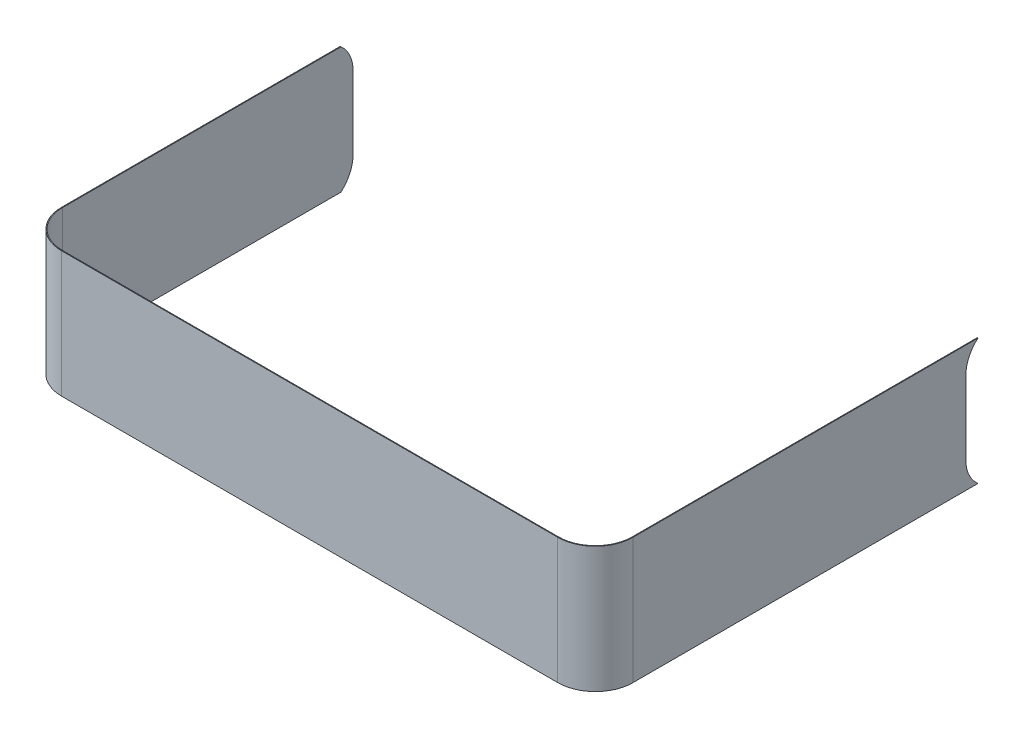
ISO-10303-21;
HEADER;
FILE_DESCRIPTION(('STEP AP214'),'2;1');
FILE_NAME('part.step','',(''),(''),'','','');
FILE_SCHEMA(('AUTOMOTIVE_DESIGN { 1 0 10303 214 1 1 1 1 }'));
ENDSEC;
DATA;
#1=APPLICATION_CONTEXT('core data for automotive mechanical design processes');
#2=APPLICATION_PROTOCOL_DEFINITION('international standard','automotive_design',2000,#1);
#3=PRODUCT_CONTEXT('',#1,'mechanical');
#4=PRODUCT('Part','Part','',(#3));
#5=PRODUCT_RELATED_PRODUCT_CATEGORY('part','',(#4));
#6=PRODUCT_DEFINITION_FORMATION('','',#4);
#7=PRODUCT_DEFINITION_CONTEXT('part definition',#1,'design');
#8=PRODUCT_DEFINITION('design','',#6,#7);
#9=PRODUCT_DEFINITION_SHAPE('','',#8);
#10=(LENGTH_UNIT() NAMED_UNIT(*) SI_UNIT(.MILLI.,.METRE.));
#11=(NAMED_UNIT(*) PLANE_ANGLE_UNIT() SI_UNIT($,.RADIAN.));
#12=(NAMED_UNIT(*) SI_UNIT($,.STERADIAN.) SOLID_ANGLE_UNIT());
#13=UNCERTAINTY_MEASURE_WITH_UNIT(LENGTH_MEASURE(1.E-05),#10,'distance_accuracy_value','');
#14=(GEOMETRIC_REPRESENTATION_CONTEXT(3) GLOBAL_UNCERTAINTY_ASSIGNED_CONTEXT((#13)) GLOBAL_UNIT_ASSIGNED_CONTEXT((#10,
#11,#12)) REPRESENTATION_CONTEXT('',''));
#15=CARTESIAN_POINT('',(0.,0.,0.));
#16=DIRECTION('',(0.,0.,1.));
#17=DIRECTION('',(1.,0.,0.));
#18=AXIS2_PLACEMENT_3D('',#15,#16,#17);
#19=CARTESIAN_POINT('',(-500.,-1672.,-500.));
#20=DIRECTION('',(1.,0.,0.));
#21=DIRECTION('',(0.,0.,-1.));
#22=AXIS2_PLACEMENT_3D('',#19,#20,#21);
#23=PLANE('',#22);
#24=DIRECTION('',(0.,0.,-1.));
#25=VECTOR('',#24,1.);
#26=CARTESIAN_POINT('',(-500.,0.,-500.));
#27=LINE('',#26,#25);
#28=CARTESIAN_POINT('',(-500.,0.,-500.));
#29=VERTEX_POINT('',#28);
#30=CARTESIAN_POINT('',(-500.,0.,-4200.49623113199));
#31=VERTEX_POINT('',#30);
#32=EDGE_CURVE('E255',#29,#31,#27,.T.);
#33=ORIENTED_EDGE('',*,*,#32,.T.);
#34=CARTESIAN_POINT('',(-500.,-350.,-3902.));
#35=DIRECTION('',(1.,0.,0.));
#36=DIRECTION('',(0.,0.,-1.));
#37=AXIS2_PLACEMENT_3D('',#34,#35,#36);
#38=CIRCLE('',#37,460.);
#39=CARTESIAN_POINT('',(-500.,-350.,-4362.));
#40=VERTEX_POINT('',#39);
#41=EDGE_CURVE('E63',#40,#31,#38,.T.);
#42=ORIENTED_EDGE('',*,*,#41,.F.);
#43=DIRECTION('',(0.,1.,0.));
#44=VECTOR('',#43,1.);
#45=CARTESIAN_POINT('',(-500.,-350.,-4362.));
#46=LINE('',#45,#44);
#47=CARTESIAN_POINT('',(-500.,-1322.,-4362.));
#48=VERTEX_POINT('',#47);
#49=EDGE_CURVE('E196',#48,#40,#46,.T.);
#50=ORIENTED_EDGE('',*,*,#49,.F.);
#51=CARTESIAN_POINT('',(-500.,-1322.,-3902.));
#52=DIRECTION('',(1.,0.,0.));
#53=DIRECTION('',(0.,0.,1.));
#54=AXIS2_PLACEMENT_3D('',#51,#52,#53);
#55=CIRCLE('',#54,460.);
#56=CARTESIAN_POINT('',(-500.,-1672.,-4200.49623113199));
#57=VERTEX_POINT('',#56);
#58=EDGE_CURVE('E192',#57,#48,#55,.T.);
#59=ORIENTED_EDGE('',*,*,#58,.F.);
#60=DIRECTION('',(0.,0.,-1.));
#61=VECTOR('',#60,1.);
#62=CARTESIAN_POINT('',(-500.,-1672.,-500.));
#63=LINE('',#62,#61);
#64=CARTESIAN_POINT('',(-500.,-1672.,-500.));
#65=VERTEX_POINT('',#64);
#66=EDGE_CURVE('E219',#65,#57,#63,.T.);
#67=ORIENTED_EDGE('',*,*,#66,.F.);
#68=DIRECTION('',(0.,1.,0.));
#69=VECTOR('',#68,1.);
#70=CARTESIAN_POINT('',(-500.,-1672.,-500.));
#71=LINE('',#70,#69);
#72=EDGE_CURVE('E309',#65,#29,#71,.T.);
#73=ORIENTED_EDGE('',*,*,#72,.T.);
#74=EDGE_LOOP('',(#33,#42,#50,#59,#67,#73));
#75=FACE_BOUND('',#74,.T.);
#76=ADVANCED_FACE('F39',(#75),#23,.F.);
#77=CARTESIAN_POINT('',(-490.,-1672.,-8890.));
#78=DIRECTION('',(-1.,0.,0.));
#79=DIRECTION('',(0.,0.,1.));
#80=AXIS2_PLACEMENT_3D('',#77,#78,#79);
#81=PLANE('',#80);
#82=DIRECTION('',(0.,1.,0.));
#83=VECTOR('',#82,1.);
#84=CARTESIAN_POINT('',(-490.,-1672.,-4362.));
#85=LINE('',#84,#83);
#86=CARTESIAN_POINT('',(-490.,-1322.,-4362.));
#87=VERTEX_POINT('',#86);
#88=CARTESIAN_POINT('',(-490.,-350.,-4362.));
#89=VERTEX_POINT('',#88);
#90=EDGE_CURVE('E319',#87,#89,#85,.T.);
#91=ORIENTED_EDGE('',*,*,#90,.T.);
#92=CARTESIAN_POINT('',(-490.,-350.,-3902.));
#93=DIRECTION('',(-1.,0.,0.));
#94=DIRECTION('',(0.,0.,1.));
#95=AXIS2_PLACEMENT_3D('',#92,#93,#94);
#96=CIRCLE('',#95,460.);
#97=CARTESIAN_POINT('',(-490.,0.,-4200.49623113199));
#98=VERTEX_POINT('',#97);
#99=EDGE_CURVE('E204',#89,#98,#96,.F.);
#100=ORIENTED_EDGE('',*,*,#99,.T.);
#101=DIRECTION('',(0.,0.,1.));
#102=VECTOR('',#101,1.);
#103=CARTESIAN_POINT('',(-490.,0.,-8890.));
#104=LINE('',#103,#102);
#105=CARTESIAN_POINT('',(-490.,0.,-500.));
#106=VERTEX_POINT('',#105);
#107=EDGE_CURVE('E259',#98,#106,#104,.T.);
#108=ORIENTED_EDGE('',*,*,#107,.T.);
#109=DIRECTION('',(0.,1.,0.));
#110=VECTOR('',#109,1.);
#111=CARTESIAN_POINT('',(-490.,-1672.,-500.));
#112=LINE('',#111,#110);
#113=CARTESIAN_POINT('',(-490.,-1672.,-500.));
#114=VERTEX_POINT('',#113);
#115=EDGE_CURVE('E305',#114,#106,#112,.T.);
#116=ORIENTED_EDGE('',*,*,#115,.F.);
#117=DIRECTION('',(0.,0.,1.));
#118=VECTOR('',#117,1.);
#119=CARTESIAN_POINT('',(-490.,-1672.,-8890.));
#120=LINE('',#119,#118);
#121=CARTESIAN_POINT('',(-490.,-1672.,-4200.49623113199));
#122=VERTEX_POINT('',#121);
#123=EDGE_CURVE('E224',#122,#114,#120,.T.);
#124=ORIENTED_EDGE('',*,*,#123,.F.);
#125=CARTESIAN_POINT('',(-490.,-1322.,-3902.));
#126=DIRECTION('',(-1.,0.,0.));
#127=DIRECTION('',(0.,0.,1.));
#128=AXIS2_PLACEMENT_3D('',#125,#126,#127);
#129=CIRCLE('',#128,460.);
#130=EDGE_CURVE('E210',#122,#87,#129,.F.);
#131=ORIENTED_EDGE('',*,*,#130,.T.);
#132=EDGE_LOOP('',(#91,#100,#108,#116,#124,#131));
#133=FACE_BOUND('',#132,.T.);
#134=ADVANCED_FACE('F348',(#133),#81,.F.);
#135=CARTESIAN_POINT('',(0.,-1672.,-500.));
#136=DIRECTION('',(0.,1.,0.));
#137=DIRECTION('',(0.,0.,1.));
#138=AXIS2_PLACEMENT_3D('',#135,#136,#137);
#139=CYLINDRICAL_SURFACE('',#138,500.);
#140=CARTESIAN_POINT('',(0.,0.,-500.));
#141=DIRECTION('',(0.,-1.,0.));
#142=DIRECTION('',(0.,0.,-1.));
#143=AXIS2_PLACEMENT_3D('',#140,#141,#142);
#144=CIRCLE('',#143,500.);
#145=CARTESIAN_POINT('',(0.,0.,0.));
#146=VERTEX_POINT('',#145);
#147=EDGE_CURVE('E214',#146,#29,#144,.T.);
#148=ORIENTED_EDGE('',*,*,#147,.T.);
#149=ORIENTED_EDGE('',*,*,#72,.F.);
#150=CARTESIAN_POINT('',(0.,-1672.,-500.));
#151=DIRECTION('',(0.,-1.,0.));
#152=DIRECTION('',(0.,0.,-1.));
#153=AXIS2_PLACEMENT_3D('',#150,#151,#152);
#154=CIRCLE('',#153,500.);
#155=CARTESIAN_POINT('',(0.,-1672.,0.));
#156=VERTEX_POINT('',#155);
#157=EDGE_CURVE('E215',#156,#65,#154,.T.);
#158=ORIENTED_EDGE('',*,*,#157,.F.);
#159=DIRECTION('',(0.,1.,0.));
#160=VECTOR('',#159,1.);
#161=CARTESIAN_POINT('',(0.,-1672.,0.));
#162=LINE('',#161,#160);
#163=EDGE_CURVE('E251',#156,#146,#162,.T.);
#164=ORIENTED_EDGE('',*,*,#163,.T.);
#165=EDGE_LOOP('',(#148,#149,#158,#164));
#166=FACE_BOUND('',#165,.T.);
#167=ADVANCED_FACE('F41',(#166),#139,.T.);
#168=CARTESIAN_POINT('',(2.22044604925031E-13,-1672.,-500.));
#169=DIRECTION('',(0.,1.,0.));
#170=DIRECTION('',(0.,0.,1.));
#171=AXIS2_PLACEMENT_3D('',#168,#169,#170);
#172=CYLINDRICAL_SURFACE('',#171,490.);
#173=CARTESIAN_POINT('',(2.22044604925031E-13,0.,-500.));
#174=DIRECTION('',(0.,1.,0.));
#175=DIRECTION('',(0.,0.,1.));
#176=AXIS2_PLACEMENT_3D('',#173,#174,#175);
#177=CIRCLE('',#176,490.);
#178=CARTESIAN_POINT('',(2.22044604925031E-13,0.,-9.99999999999973));
#179=VERTEX_POINT('',#178);
#180=EDGE_CURVE('E262',#106,#179,#177,.T.);
#181=ORIENTED_EDGE('',*,*,#180,.T.);
#182=DIRECTION('',(0.,1.,0.));
#183=VECTOR('',#182,1.);
#184=CARTESIAN_POINT('',(2.22044604925031E-13,-1672.,-9.99999999999973));
#185=LINE('',#184,#183);
#186=CARTESIAN_POINT('',(2.22044604925031E-13,-1672.,-9.99999999999973));
#187=VERTEX_POINT('',#186);
#188=EDGE_CURVE('E301',#187,#179,#185,.T.);
#189=ORIENTED_EDGE('',*,*,#188,.F.);
#190=CARTESIAN_POINT('',(2.22044604925031E-13,-1672.,-500.));
#191=DIRECTION('',(0.,1.,0.));
#192=DIRECTION('',(0.,0.,1.));
#193=AXIS2_PLACEMENT_3D('',#190,#191,#192);
#194=CIRCLE('',#193,490.);
#195=EDGE_CURVE('E227',#114,#187,#194,.T.);
#196=ORIENTED_EDGE('',*,*,#195,.F.);
#197=ORIENTED_EDGE('',*,*,#115,.T.);
#198=EDGE_LOOP('',(#181,#189,#196,#197));
#199=FACE_BOUND('',#198,.T.);
#200=ADVANCED_FACE('F344',(#199),#172,.F.);
#201=CARTESIAN_POINT('',(1.11022302462516E-13,-1672.,-9.99999999999979));
#202=DIRECTION('',(0.,0.,1.));
#203=DIRECTION('',(1.,0.,0.));
#204=AXIS2_PLACEMENT_3D('',#201,#202,#203);
#205=PLANE('',#204);
#206=DIRECTION('',(1.,0.,0.));
#207=VECTOR('',#206,1.);
#208=CARTESIAN_POINT('',(1.11022302462516E-13,0.,-9.99999999999979));
#209=LINE('',#208,#207);
#210=CARTESIAN_POINT('',(6590.,0.,-9.99999999999973));
#211=VERTEX_POINT('',#210);
#212=EDGE_CURVE('E265',#179,#211,#209,.T.);
#213=ORIENTED_EDGE('',*,*,#212,.T.);
#214=DIRECTION('',(0.,1.,0.));
#215=VECTOR('',#214,1.);
#216=CARTESIAN_POINT('',(6590.,-1672.,-9.99999999999973));
#217=LINE('',#216,#215);
#218=CARTESIAN_POINT('',(6590.,-1672.,-9.99999999999973));
#219=VERTEX_POINT('',#218);
#220=EDGE_CURVE('E297',#219,#211,#217,.T.);
#221=ORIENTED_EDGE('',*,*,#220,.F.);
#222=DIRECTION('',(1.,0.,0.));
#223=VECTOR('',#222,1.);
#224=CARTESIAN_POINT('',(1.11022302462516E-13,-1672.,-9.99999999999979));
#225=LINE('',#224,#223);
#226=EDGE_CURVE('E230',#187,#219,#225,.T.);
#227=ORIENTED_EDGE('',*,*,#226,.F.);
#228=ORIENTED_EDGE('',*,*,#188,.T.);
#229=EDGE_LOOP('',(#213,#221,#227,#228));
#230=FACE_BOUND('',#229,.T.);
#231=ADVANCED_FACE('F339',(#230),#205,.F.);
#232=CARTESIAN_POINT('',(6590.,-1672.,-499.999999999999));
#233=DIRECTION('',(0.,1.,0.));
#234=DIRECTION('',(0.,0.,1.));
#235=AXIS2_PLACEMENT_3D('',#232,#233,#234);
#236=CYLINDRICAL_SURFACE('',#235,490.);
#237=CARTESIAN_POINT('',(6590.,0.,-499.999999999999));
#238=DIRECTION('',(0.,1.,0.));
#239=DIRECTION('',(0.,0.,1.));
#240=AXIS2_PLACEMENT_3D('',#237,#238,#239);
#241=CIRCLE('',#240,490.);
#242=CARTESIAN_POINT('',(7080.,0.,-499.999999999999));
#243=VERTEX_POINT('',#242);
#244=EDGE_CURVE('E268',#211,#243,#241,.T.);
#245=ORIENTED_EDGE('',*,*,#244,.T.);
#246=DIRECTION('',(0.,1.,0.));
#247=VECTOR('',#246,1.);
#248=CARTESIAN_POINT('',(7080.,-1672.,-499.999999999999));
#249=LINE('',#248,#247);
#250=CARTESIAN_POINT('',(7080.,-1672.,-499.999999999999));
#251=VERTEX_POINT('',#250);
#252=EDGE_CURVE('E293',#251,#243,#249,.T.);
#253=ORIENTED_EDGE('',*,*,#252,.F.);
#254=CARTESIAN_POINT('',(6590.,-1672.,-499.999999999999));
#255=DIRECTION('',(0.,1.,0.));
#256=DIRECTION('',(0.,0.,1.));
#257=AXIS2_PLACEMENT_3D('',#254,#255,#256);
#258=CIRCLE('',#257,490.);
#259=EDGE_CURVE('E233',#219,#251,#258,.T.);
#260=ORIENTED_EDGE('',*,*,#259,.F.);
#261=ORIENTED_EDGE('',*,*,#220,.T.);
#262=EDGE_LOOP('',(#245,#253,#260,#261));
#263=FACE_BOUND('',#262,.T.);
#264=ADVANCED_FACE('F333',(#263),#236,.F.);
#265=CARTESIAN_POINT('',(7080.,-1672.,-499.999999999999));
#266=DIRECTION('',(1.,0.,0.));
#267=DIRECTION('',(0.,0.,-1.));
#268=AXIS2_PLACEMENT_3D('',#265,#266,#267);
#269=PLANE('',#268);
#270=DIRECTION('',(0.,-1.,0.));
#271=VECTOR('',#270,1.);
#272=CARTESIAN_POINT('',(7080.,-1672.,-4920.));
#273=LINE('',#272,#271);
#274=CARTESIAN_POINT('',(7080.,-350.,-4920.));
#275=VERTEX_POINT('',#274);
#276=CARTESIAN_POINT('',(7080.,-1322.,-4920.));
#277=VERTEX_POINT('',#276);
#278=EDGE_CURVE('E160',#275,#277,#273,.T.);
#279=ORIENTED_EDGE('',*,*,#278,.T.);
#280=CARTESIAN_POINT('',(7080.,-1322.,-5380.));
#281=DIRECTION('',(1.,0.,0.));
#282=DIRECTION('',(0.,0.,-1.));
#283=AXIS2_PLACEMENT_3D('',#280,#281,#282);
#284=CIRCLE('',#283,460.);
#285=CARTESIAN_POINT('',(7080.,-1672.,-5081.50376886801));
#286=VERTEX_POINT('',#285);
#287=EDGE_CURVE('E184',#277,#286,#284,.T.);
#288=ORIENTED_EDGE('',*,*,#287,.T.);
#289=DIRECTION('',(0.,0.,-1.));
#290=VECTOR('',#289,1.);
#291=CARTESIAN_POINT('',(7080.,-1672.,-499.999999999999));
#292=LINE('',#291,#290);
#293=EDGE_CURVE('E236',#251,#286,#292,.T.);
#294=ORIENTED_EDGE('',*,*,#293,.F.);
#295=ORIENTED_EDGE('',*,*,#252,.T.);
#296=DIRECTION('',(0.,0.,-1.));
#297=VECTOR('',#296,1.);
#298=CARTESIAN_POINT('',(7080.,0.,-499.999999999999));
#299=LINE('',#298,#297);
#300=CARTESIAN_POINT('',(7080.,0.,-5081.50376886801));
#301=VERTEX_POINT('',#300);
#302=EDGE_CURVE('E271',#243,#301,#299,.T.);
#303=ORIENTED_EDGE('',*,*,#302,.T.);
#304=CARTESIAN_POINT('',(7080.,-350.,-5380.));
#305=DIRECTION('',(1.,0.,0.));
#306=DIRECTION('',(0.,0.,-1.));
#307=AXIS2_PLACEMENT_3D('',#304,#305,#306);
#308=CIRCLE('',#307,460.);
#309=EDGE_CURVE('E55',#301,#275,#308,.T.);
#310=ORIENTED_EDGE('',*,*,#309,.T.);
#311=EDGE_LOOP('',(#279,#288,#294,#295,#303,#310));
#312=FACE_BOUND('',#311,.T.);
#313=ADVANCED_FACE('F328',(#312),#269,.F.);
#314=CARTESIAN_POINT('',(7090.,-1672.,-499.999999999999));
#315=DIRECTION('',(1.,0.,0.));
#316=DIRECTION('',(0.,0.,-1.));
#317=AXIS2_PLACEMENT_3D('',#314,#315,#316);
#318=PLANE('',#317);
#319=CARTESIAN_POINT('',(7090.,-1322.,-5380.));
#320=DIRECTION('',(1.,0.,0.));
#321=DIRECTION('',(0.,0.,-1.));
#322=AXIS2_PLACEMENT_3D('',#319,#320,#321);
#323=CIRCLE('',#322,460.);
#324=CARTESIAN_POINT('',(7090.,-1322.,-4920.));
#325=VERTEX_POINT('',#324);
#326=CARTESIAN_POINT('',(7090.,-1672.,-5081.50376886801));
#327=VERTEX_POINT('',#326);
#328=EDGE_CURVE('E163',#325,#327,#323,.T.);
#329=ORIENTED_EDGE('',*,*,#328,.F.);
#330=DIRECTION('',(0.,-1.,0.));
#331=VECTOR('',#330,1.);
#332=CARTESIAN_POINT('',(7090.,-350.,-4920.));
#333=LINE('',#332,#331);
#334=CARTESIAN_POINT('',(7090.,-350.,-4920.));
#335=VERTEX_POINT('',#334);
#336=EDGE_CURVE('E157',#335,#325,#333,.T.);
#337=ORIENTED_EDGE('',*,*,#336,.F.);
#338=CARTESIAN_POINT('',(7090.,-350.,-5380.));
#339=DIRECTION('',(1.,0.,0.));
#340=DIRECTION('',(0.,0.,1.));
#341=AXIS2_PLACEMENT_3D('',#338,#339,#340);
#342=CIRCLE('',#341,460.);
#343=CARTESIAN_POINT('',(7090.,0.,-5081.50376886801));
#344=VERTEX_POINT('',#343);
#345=EDGE_CURVE('E166',#344,#335,#342,.T.);
#346=ORIENTED_EDGE('',*,*,#345,.F.);
#347=DIRECTION('',(0.,0.,-1.));
#348=VECTOR('',#347,1.);
#349=CARTESIAN_POINT('',(7090.,0.,-499.999999999999));
#350=LINE('',#349,#348);
#351=CARTESIAN_POINT('',(7090.,0.,-499.999999999999));
#352=VERTEX_POINT('',#351);
#353=EDGE_CURVE('E275',#352,#344,#350,.T.);
#354=ORIENTED_EDGE('',*,*,#353,.F.);
#355=DIRECTION('',(0.,1.,0.));
#356=VECTOR('',#355,1.);
#357=CARTESIAN_POINT('',(7090.,-1672.,-499.999999999999));
#358=LINE('',#357,#356);
#359=CARTESIAN_POINT('',(7090.,-1672.,-499.999999999999));
#360=VERTEX_POINT('',#359);
#361=EDGE_CURVE('E290',#360,#352,#358,.T.);
#362=ORIENTED_EDGE('',*,*,#361,.F.);
#363=DIRECTION('',(0.,0.,-1.));
#364=VECTOR('',#363,1.);
#365=CARTESIAN_POINT('',(7090.,-1672.,-499.999999999999));
#366=LINE('',#365,#364);
#367=EDGE_CURVE('E240',#360,#327,#366,.T.);
#368=ORIENTED_EDGE('',*,*,#367,.T.);
#369=EDGE_LOOP('',(#329,#337,#346,#354,#362,#368));
#370=FACE_BOUND('',#369,.T.);
#371=ADVANCED_FACE('F173',(#370),#318,.T.);
#372=CARTESIAN_POINT('',(6590.,-1672.,-499.999999999999));
#373=DIRECTION('',(0.,1.,0.));
#374=DIRECTION('',(0.,0.,1.));
#375=AXIS2_PLACEMENT_3D('',#372,#373,#374);
#376=CYLINDRICAL_SURFACE('',#375,499.999999999999);
#377=CARTESIAN_POINT('',(6590.,0.,-499.999999999999));
#378=DIRECTION('',(0.,1.,0.));
#379=DIRECTION('',(0.,0.,1.));
#380=AXIS2_PLACEMENT_3D('',#377,#378,#379);
#381=CIRCLE('',#380,499.999999999999);
#382=CARTESIAN_POINT('',(6590.,0.,0.));
#383=VERTEX_POINT('',#382);
#384=EDGE_CURVE('E278',#383,#352,#381,.T.);
#385=ORIENTED_EDGE('',*,*,#384,.F.);
#386=DIRECTION('',(0.,1.,0.));
#387=VECTOR('',#386,1.);
#388=CARTESIAN_POINT('',(6590.,-1672.,0.));
#389=LINE('',#388,#387);
#390=CARTESIAN_POINT('',(6590.,-1672.,0.));
#391=VERTEX_POINT('',#390);
#392=EDGE_CURVE('E287',#391,#383,#389,.T.);
#393=ORIENTED_EDGE('',*,*,#392,.F.);
#394=CARTESIAN_POINT('',(6590.,-1672.,-499.999999999999));
#395=DIRECTION('',(0.,1.,0.));
#396=DIRECTION('',(0.,0.,1.));
#397=AXIS2_PLACEMENT_3D('',#394,#395,#396);
#398=CIRCLE('',#397,499.999999999999);
#399=EDGE_CURVE('E243',#391,#360,#398,.T.);
#400=ORIENTED_EDGE('',*,*,#399,.T.);
#401=ORIENTED_EDGE('',*,*,#361,.T.);
#402=EDGE_LOOP('',(#385,#393,#400,#401));
#403=FACE_BOUND('',#402,.T.);
#404=ADVANCED_FACE('F363',(#403),#376,.T.);
#405=CARTESIAN_POINT('',(0.,-1672.,0.));
#406=DIRECTION('',(0.,0.,1.));
#407=DIRECTION('',(1.,0.,0.));
#408=AXIS2_PLACEMENT_3D('',#405,#406,#407);
#409=PLANE('',#408);
#410=DIRECTION('',(1.,0.,0.));
#411=VECTOR('',#410,1.);
#412=CARTESIAN_POINT('',(0.,0.,0.));
#413=LINE('',#412,#411);
#414=EDGE_CURVE('E220',#146,#383,#413,.T.);
#415=ORIENTED_EDGE('',*,*,#414,.F.);
#416=ORIENTED_EDGE('',*,*,#163,.F.);
#417=DIRECTION('',(1.,0.,0.));
#418=VECTOR('',#417,1.);
#419=CARTESIAN_POINT('',(0.,-1672.,0.));
#420=LINE('',#419,#418);
#421=EDGE_CURVE('E247',#156,#391,#420,.T.);
#422=ORIENTED_EDGE('',*,*,#421,.T.);
#423=ORIENTED_EDGE('',*,*,#392,.T.);
#424=EDGE_LOOP('',(#415,#416,#422,#423));
#425=FACE_BOUND('',#424,.T.);
#426=ADVANCED_FACE('F358',(#425),#409,.T.);
#427=CARTESIAN_POINT('',(0.,-1672.,-500.));
#428=DIRECTION('',(0.,-1.,0.));
#429=DIRECTION('',(0.,0.,-1.));
#430=AXIS2_PLACEMENT_3D('',#427,#428,#429);
#431=PLANE('',#430);
#432=DIRECTION('',(1.,0.,0.));
#433=VECTOR('',#432,1.);
#434=CARTESIAN_POINT('',(7070.,-1672.,-5081.50376886801));
#435=LINE('',#434,#433);
#436=EDGE_CURVE('E11',#327,#286,#435,.F.);
#437=ORIENTED_EDGE('',*,*,#436,.F.);
#438=ORIENTED_EDGE('',*,*,#367,.F.);
#439=ORIENTED_EDGE('',*,*,#399,.F.);
#440=ORIENTED_EDGE('',*,*,#421,.F.);
#441=ORIENTED_EDGE('',*,*,#157,.T.);
#442=ORIENTED_EDGE('',*,*,#66,.T.);
#443=DIRECTION('',(-1.,0.,0.));
#444=VECTOR('',#443,1.);
#445=CARTESIAN_POINT('',(-480.,-1672.,-4200.49623113199));
#446=LINE('',#445,#444);
#447=EDGE_CURVE('E316',#122,#57,#446,.T.);
#448=ORIENTED_EDGE('',*,*,#447,.F.);
#449=ORIENTED_EDGE('',*,*,#123,.T.);
#450=ORIENTED_EDGE('',*,*,#195,.T.);
#451=ORIENTED_EDGE('',*,*,#226,.T.);
#452=ORIENTED_EDGE('',*,*,#259,.T.);
#453=ORIENTED_EDGE('',*,*,#293,.T.);
#454=EDGE_LOOP('',(#437,#438,#439,#440,#441,#442,#448,#449,#450,#451,#452,#453));
#455=FACE_BOUND('',#454,.T.);
#456=ADVANCED_FACE('F367',(#455),#431,.T.);
#457=CARTESIAN_POINT('',(0.,0.,-500.));
#458=DIRECTION('',(0.,-1.,0.));
#459=DIRECTION('',(0.,0.,-1.));
#460=AXIS2_PLACEMENT_3D('',#457,#458,#459);
#461=PLANE('',#460);
#462=ORIENTED_EDGE('',*,*,#353,.T.);
#463=DIRECTION('',(1.,0.,0.));
#464=VECTOR('',#463,1.);
#465=CARTESIAN_POINT('',(7070.,0.,-5081.50376886801));
#466=LINE('',#465,#464);
#467=EDGE_CURVE('E48',#344,#301,#466,.F.);
#468=ORIENTED_EDGE('',*,*,#467,.T.);
#469=ORIENTED_EDGE('',*,*,#302,.F.);
#470=ORIENTED_EDGE('',*,*,#244,.F.);
#471=ORIENTED_EDGE('',*,*,#212,.F.);
#472=ORIENTED_EDGE('',*,*,#180,.F.);
#473=ORIENTED_EDGE('',*,*,#107,.F.);
#474=DIRECTION('',(-1.,0.,0.));
#475=VECTOR('',#474,1.);
#476=CARTESIAN_POINT('',(-480.,0.,-4200.49623113199));
#477=LINE('',#476,#475);
#478=EDGE_CURVE('E313',#98,#31,#477,.T.);
#479=ORIENTED_EDGE('',*,*,#478,.T.);
#480=ORIENTED_EDGE('',*,*,#32,.F.);
#481=ORIENTED_EDGE('',*,*,#147,.F.);
#482=ORIENTED_EDGE('',*,*,#414,.T.);
#483=ORIENTED_EDGE('',*,*,#384,.T.);
#484=EDGE_LOOP('',(#462,#468,#469,#470,#471,#472,#473,#479,#480,#481,#482,#483));
#485=FACE_BOUND('',#484,.T.);
#486=ADVANCED_FACE('F325',(#485),#461,.F.);
#487=CARTESIAN_POINT('',(-480.,-350.,-4362.));
#488=DIRECTION('',(0.,0.,1.));
#489=DIRECTION('',(1.,0.,0.));
#490=AXIS2_PLACEMENT_3D('',#487,#488,#489);
#491=PLANE('',#490);
#492=DIRECTION('',(-1.,0.,0.));
#493=VECTOR('',#492,1.);
#494=CARTESIAN_POINT('',(-480.,-1322.,-4362.));
#495=LINE('',#494,#493);
#496=EDGE_CURVE('E200',#87,#48,#495,.T.);
#497=ORIENTED_EDGE('',*,*,#496,.T.);
#498=ORIENTED_EDGE('',*,*,#49,.T.);
#499=DIRECTION('',(-1.,0.,0.));
#500=VECTOR('',#499,1.);
#501=CARTESIAN_POINT('',(-480.,-350.,-4362.));
#502=LINE('',#501,#500);
#503=EDGE_CURVE('E201',#89,#40,#502,.T.);
#504=ORIENTED_EDGE('',*,*,#503,.F.);
#505=ORIENTED_EDGE('',*,*,#90,.F.);
#506=EDGE_LOOP('',(#497,#498,#504,#505));
#507=FACE_BOUND('',#506,.T.);
#508=ADVANCED_FACE('F401',(#507),#491,.F.);
#509=CARTESIAN_POINT('',(-480.,-1322.,-3902.));
#510=DIRECTION('',(-1.,0.,0.));
#511=DIRECTION('',(0.,0.,1.));
#512=AXIS2_PLACEMENT_3D('',#509,#510,#511);
#513=CYLINDRICAL_SURFACE('',#512,460.);
#514=ORIENTED_EDGE('',*,*,#447,.T.);
#515=ORIENTED_EDGE('',*,*,#58,.T.);
#516=ORIENTED_EDGE('',*,*,#496,.F.);
#517=ORIENTED_EDGE('',*,*,#130,.F.);
#518=EDGE_LOOP('',(#514,#515,#516,#517));
#519=FACE_BOUND('',#518,.T.);
#520=ADVANCED_FACE('F406',(#519),#513,.T.);
#521=CARTESIAN_POINT('',(-480.,-350.,-3902.));
#522=DIRECTION('',(-1.,0.,0.));
#523=DIRECTION('',(0.,0.,1.));
#524=AXIS2_PLACEMENT_3D('',#521,#522,#523);
#525=CYLINDRICAL_SURFACE('',#524,460.);
#526=ORIENTED_EDGE('',*,*,#503,.T.);
#527=ORIENTED_EDGE('',*,*,#41,.T.);
#528=ORIENTED_EDGE('',*,*,#478,.F.);
#529=ORIENTED_EDGE('',*,*,#99,.F.);
#530=EDGE_LOOP('',(#526,#527,#528,#529));
#531=FACE_BOUND('',#530,.T.);
#532=ADVANCED_FACE('F377',(#531),#525,.T.);
#533=CARTESIAN_POINT('',(7070.,-350.,-4920.));
#534=DIRECTION('',(0.,0.,1.));
#535=DIRECTION('',(1.,0.,0.));
#536=AXIS2_PLACEMENT_3D('',#533,#534,#535);
#537=PLANE('',#536);
#538=DIRECTION('',(1.,0.,0.));
#539=VECTOR('',#538,1.);
#540=CARTESIAN_POINT('',(7070.,-350.,-4920.));
#541=LINE('',#540,#539);
#542=EDGE_CURVE('E152',#275,#335,#541,.T.);
#543=ORIENTED_EDGE('',*,*,#542,.T.);
#544=ORIENTED_EDGE('',*,*,#336,.T.);
#545=DIRECTION('',(1.,0.,0.));
#546=VECTOR('',#545,1.);
#547=CARTESIAN_POINT('',(7070.,-1322.,-4920.));
#548=LINE('',#547,#546);
#549=EDGE_CURVE('E162',#277,#325,#548,.T.);
#550=ORIENTED_EDGE('',*,*,#549,.F.);
#551=ORIENTED_EDGE('',*,*,#278,.F.);
#552=EDGE_LOOP('',(#543,#544,#550,#551));
#553=FACE_BOUND('',#552,.T.);
#554=ADVANCED_FACE('F154',(#553),#537,.F.);
#555=CARTESIAN_POINT('',(7070.,-1322.,-5380.));
#556=DIRECTION('',(1.,0.,0.));
#557=DIRECTION('',(0.,0.,-1.));
#558=AXIS2_PLACEMENT_3D('',#555,#556,#557);
#559=CYLINDRICAL_SURFACE('',#558,460.);
#560=ORIENTED_EDGE('',*,*,#549,.T.);
#561=ORIENTED_EDGE('',*,*,#328,.T.);
#562=ORIENTED_EDGE('',*,*,#436,.T.);
#563=ORIENTED_EDGE('',*,*,#287,.F.);
#564=EDGE_LOOP('',(#560,#561,#562,#563));
#565=FACE_BOUND('',#564,.T.);
#566=ADVANCED_FACE('F369',(#565),#559,.F.);
#567=CARTESIAN_POINT('',(7070.,-350.,-5380.));
#568=DIRECTION('',(1.,0.,0.));
#569=DIRECTION('',(0.,0.,-1.));
#570=AXIS2_PLACEMENT_3D('',#567,#568,#569);
#571=CYLINDRICAL_SURFACE('',#570,460.);
#572=ORIENTED_EDGE('',*,*,#467,.F.);
#573=ORIENTED_EDGE('',*,*,#345,.T.);
#574=ORIENTED_EDGE('',*,*,#542,.F.);
#575=ORIENTED_EDGE('',*,*,#309,.F.);
#576=EDGE_LOOP('',(#572,#573,#574,#575));
#577=FACE_BOUND('',#576,.T.);
#578=ADVANCED_FACE('F167',(#577),#571,.F.);
#579=CLOSED_SHELL('',(#76,#134,#167,#200,#231,#264,#313,#371,#404,#426,#456,#486,#508,#520,#532,
#554,#566,#578));
#580=MANIFOLD_SOLID_BREP('B2',#579);
#581=ADVANCED_BREP_SHAPE_REPRESENTATION('',(#18,#580),#14);
#582=SHAPE_DEFINITION_REPRESENTATION(#9,#581);
ENDSEC;
END-ISO-10303-21;
